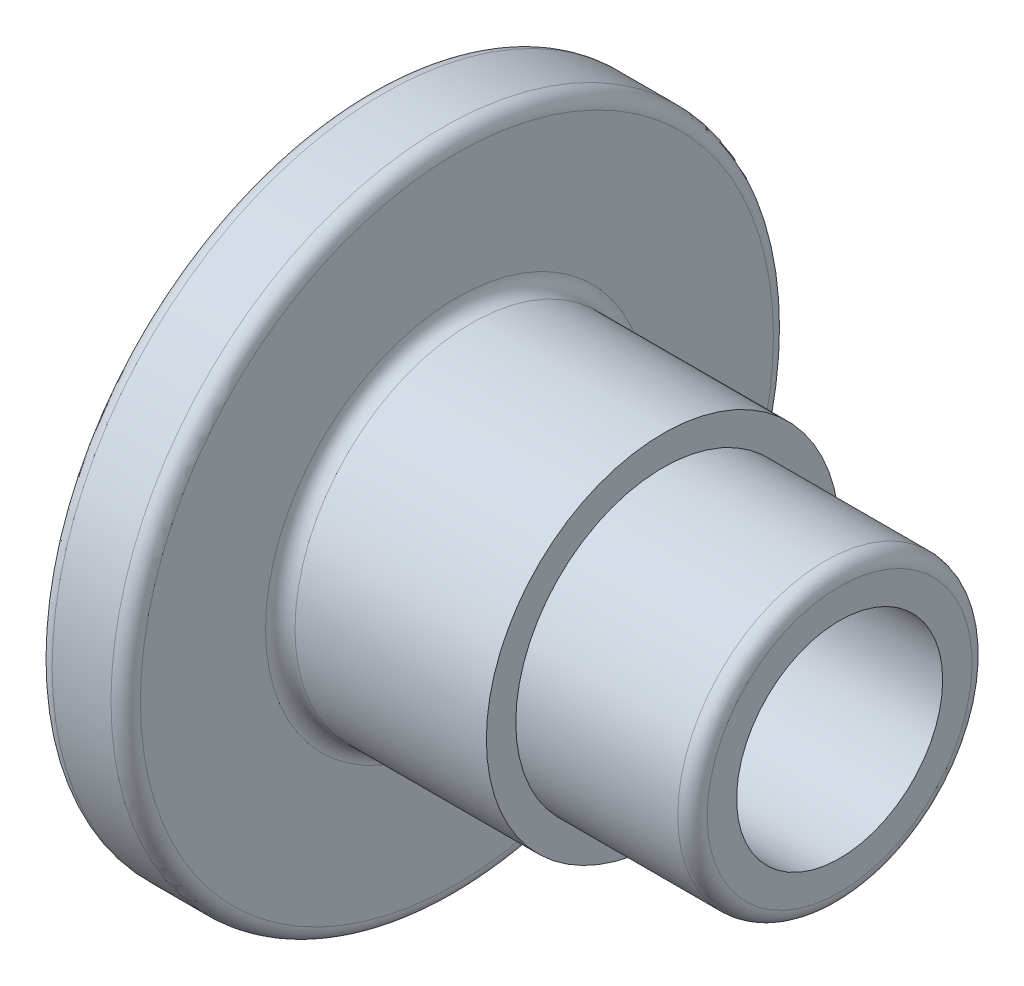
ISO-10303-21;
HEADER;
FILE_DESCRIPTION(('STEP AP214'),'2;1');
FILE_NAME('part.step','',(''),(''),'','','');
FILE_SCHEMA(('AUTOMOTIVE_DESIGN { 1 0 10303 214 1 1 1 1 }'));
ENDSEC;
DATA;
#1=APPLICATION_CONTEXT('core data for automotive mechanical design processes');
#2=APPLICATION_PROTOCOL_DEFINITION('international standard','automotive_design',2000,#1);
#3=PRODUCT_CONTEXT('',#1,'mechanical');
#4=PRODUCT('Part','Part','',(#3));
#5=PRODUCT_RELATED_PRODUCT_CATEGORY('part','',(#4));
#6=PRODUCT_DEFINITION_FORMATION('','',#4);
#7=PRODUCT_DEFINITION_CONTEXT('part definition',#1,'design');
#8=PRODUCT_DEFINITION('design','',#6,#7);
#9=PRODUCT_DEFINITION_SHAPE('','',#8);
#10=(LENGTH_UNIT() NAMED_UNIT(*) SI_UNIT(.MILLI.,.METRE.));
#11=(NAMED_UNIT(*) PLANE_ANGLE_UNIT() SI_UNIT($,.RADIAN.));
#12=(NAMED_UNIT(*) SI_UNIT($,.STERADIAN.) SOLID_ANGLE_UNIT());
#13=UNCERTAINTY_MEASURE_WITH_UNIT(LENGTH_MEASURE(1.E-05),#10,'distance_accuracy_value','');
#14=(GEOMETRIC_REPRESENTATION_CONTEXT(3) GLOBAL_UNCERTAINTY_ASSIGNED_CONTEXT((#13)) GLOBAL_UNIT_ASSIGNED_CONTEXT((#10,
#11,#12)) REPRESENTATION_CONTEXT('',''));
#15=CARTESIAN_POINT('',(0.,0.,0.));
#16=DIRECTION('',(0.,0.,1.));
#17=DIRECTION('',(1.,0.,0.));
#18=AXIS2_PLACEMENT_3D('',#15,#16,#17);
#19=CARTESIAN_POINT('',(16.,0.,0.));
#20=DIRECTION('',(1.,0.,0.));
#21=DIRECTION('',(0.,0.,-1.));
#22=AXIS2_PLACEMENT_3D('',#19,#20,#21);
#23=CYLINDRICAL_SURFACE('',#22,3.49999999999999);
#24=CARTESIAN_POINT('',(16.,0.,0.));
#25=DIRECTION('',(1.,0.,0.));
#26=DIRECTION('',(0.,0.,-1.));
#27=AXIS2_PLACEMENT_3D('',#24,#25,#26);
#28=CIRCLE('',#27,3.49999999999999);
#29=CARTESIAN_POINT('',(16.,0.,-3.49999999999999));
#30=VERTEX_POINT('',#29);
#31=EDGE_CURVE('E67',#30,#30,#28,.T.);
#32=ORIENTED_EDGE('',*,*,#31,.T.);
#33=EDGE_LOOP('',(#32));
#34=FACE_BOUND('',#33,.T.);
#35=CARTESIAN_POINT('',(5.,0.,0.));
#36=DIRECTION('',(-1.,0.,0.));
#37=DIRECTION('',(0.,0.,1.));
#38=AXIS2_PLACEMENT_3D('',#35,#36,#37);
#39=CIRCLE('',#38,3.49999999999999);
#40=CARTESIAN_POINT('',(5.,0.,3.49999999999999));
#41=VERTEX_POINT('',#40);
#42=EDGE_CURVE('E33',#41,#41,#39,.F.);
#43=ORIENTED_EDGE('',*,*,#42,.F.);
#44=EDGE_LOOP('',(#43));
#45=FACE_BOUND('',#44,.T.);
#46=ADVANCED_FACE('F29',(#34,#45),#23,.F.);
#47=CARTESIAN_POINT('',(0.,0.,0.));
#48=DIRECTION('',(1.,0.,0.));
#49=DIRECTION('',(0.,0.,-1.));
#50=AXIS2_PLACEMENT_3D('',#47,#48,#49);
#51=PLANE('',#50);
#52=CARTESIAN_POINT('',(0.,0.,0.));
#53=DIRECTION('',(-1.,0.,0.));
#54=DIRECTION('',(0.,0.,1.));
#55=AXIS2_PLACEMENT_3D('',#52,#53,#54);
#56=CIRCLE('',#55,5.);
#57=CARTESIAN_POINT('',(0.,0.,5.));
#58=VERTEX_POINT('',#57);
#59=EDGE_CURVE('E70',#58,#58,#56,.T.);
#60=ORIENTED_EDGE('',*,*,#59,.F.);
#61=EDGE_LOOP('',(#60));
#62=FACE_BOUND('',#61,.T.);
#63=CARTESIAN_POINT('',(0.,0.,0.));
#64=DIRECTION('',(1.,0.,0.));
#65=DIRECTION('',(0.,0.,-1.));
#66=AXIS2_PLACEMENT_3D('',#63,#64,#65);
#67=CIRCLE('',#66,10.75);
#68=CARTESIAN_POINT('',(0.,0.,-10.75));
#69=VERTEX_POINT('',#68);
#70=EDGE_CURVE('E52',#69,#69,#67,.F.);
#71=ORIENTED_EDGE('',*,*,#70,.T.);
#72=EDGE_LOOP('',(#71));
#73=FACE_BOUND('',#72,.T.);
#74=ADVANCED_FACE('F83',(#62,#73),#51,.F.);
#75=CARTESIAN_POINT('',(0.,0.,0.));
#76=DIRECTION('',(-1.,0.,0.));
#77=DIRECTION('',(0.,0.,1.));
#78=AXIS2_PLACEMENT_3D('',#75,#76,#77);
#79=CYLINDRICAL_SURFACE('',#78,11.25);
#80=CARTESIAN_POINT('',(0.5,0.,0.));
#81=DIRECTION('',(1.,0.,0.));
#82=DIRECTION('',(0.,0.,-1.));
#83=AXIS2_PLACEMENT_3D('',#80,#81,#82);
#84=CIRCLE('',#83,11.25);
#85=CARTESIAN_POINT('',(0.5,0.,-11.25));
#86=VERTEX_POINT('',#85);
#87=EDGE_CURVE('E46',#86,#86,#84,.T.);
#88=ORIENTED_EDGE('',*,*,#87,.T.);
#89=EDGE_LOOP('',(#88));
#90=FACE_BOUND('',#89,.T.);
#91=CARTESIAN_POINT('',(2.5,0.,0.));
#92=DIRECTION('',(-1.,0.,0.));
#93=DIRECTION('',(0.,0.,1.));
#94=AXIS2_PLACEMENT_3D('',#91,#92,#93);
#95=CIRCLE('',#94,11.25);
#96=CARTESIAN_POINT('',(2.5,0.,11.25));
#97=VERTEX_POINT('',#96);
#98=EDGE_CURVE('E49',#97,#97,#95,.T.);
#99=ORIENTED_EDGE('',*,*,#98,.T.);
#100=EDGE_LOOP('',(#99));
#101=FACE_BOUND('',#100,.T.);
#102=ADVANCED_FACE('F89',(#90,#101),#79,.T.);
#103=CARTESIAN_POINT('',(3.,11.25,0.));
#104=DIRECTION('',(-1.,0.,0.));
#105=DIRECTION('',(0.,0.,1.));
#106=AXIS2_PLACEMENT_3D('',#103,#104,#105);
#107=PLANE('',#106);
#108=CARTESIAN_POINT('',(3.,0.,0.));
#109=DIRECTION('',(-1.,0.,0.));
#110=DIRECTION('',(0.,0.,1.));
#111=AXIS2_PLACEMENT_3D('',#108,#109,#110);
#112=CIRCLE('',#111,10.75);
#113=CARTESIAN_POINT('',(3.,0.,10.75));
#114=VERTEX_POINT('',#113);
#115=EDGE_CURVE('E37',#114,#114,#112,.F.);
#116=ORIENTED_EDGE('',*,*,#115,.T.);
#117=EDGE_LOOP('',(#116));
#118=FACE_BOUND('',#117,.T.);
#119=CARTESIAN_POINT('',(3.,0.,0.));
#120=DIRECTION('',(-1.,0.,0.));
#121=DIRECTION('',(0.,0.,1.));
#122=AXIS2_PLACEMENT_3D('',#119,#120,#121);
#123=CIRCLE('',#122,6.5);
#124=CARTESIAN_POINT('',(3.,0.,6.5));
#125=VERTEX_POINT('',#124);
#126=EDGE_CURVE('E41',#125,#125,#123,.T.);
#127=ORIENTED_EDGE('',*,*,#126,.T.);
#128=EDGE_LOOP('',(#127));
#129=FACE_BOUND('',#128,.T.);
#130=ADVANCED_FACE('F112',(#118,#129),#107,.F.);
#131=CARTESIAN_POINT('',(0.,0.,0.));
#132=DIRECTION('',(-1.,0.,0.));
#133=DIRECTION('',(0.,0.,1.));
#134=AXIS2_PLACEMENT_3D('',#131,#132,#133);
#135=CYLINDRICAL_SURFACE('',#134,6.);
#136=CARTESIAN_POINT('',(3.5,0.,0.));
#137=DIRECTION('',(-1.,0.,0.));
#138=DIRECTION('',(0.,0.,1.));
#139=AXIS2_PLACEMENT_3D('',#136,#137,#138);
#140=CIRCLE('',#139,6.);
#141=CARTESIAN_POINT('',(3.5,0.,6.));
#142=VERTEX_POINT('',#141);
#143=EDGE_CURVE('E10',#142,#142,#140,.F.);
#144=ORIENTED_EDGE('',*,*,#143,.T.);
#145=EDGE_LOOP('',(#144));
#146=FACE_BOUND('',#145,.T.);
#147=CARTESIAN_POINT('',(10.,0.,0.));
#148=DIRECTION('',(-1.,0.,0.));
#149=DIRECTION('',(0.,0.,1.));
#150=AXIS2_PLACEMENT_3D('',#147,#148,#149);
#151=CIRCLE('',#150,6.);
#152=CARTESIAN_POINT('',(10.,0.,6.));
#153=VERTEX_POINT('',#152);
#154=EDGE_CURVE('E61',#153,#153,#151,.T.);
#155=ORIENTED_EDGE('',*,*,#154,.T.);
#156=EDGE_LOOP('',(#155));
#157=FACE_BOUND('',#156,.T.);
#158=ADVANCED_FACE('F108',(#146,#157),#135,.T.);
#159=CARTESIAN_POINT('',(10.,6.,0.));
#160=DIRECTION('',(-1.,0.,0.));
#161=DIRECTION('',(0.,0.,1.));
#162=AXIS2_PLACEMENT_3D('',#159,#160,#161);
#163=PLANE('',#162);
#164=ORIENTED_EDGE('',*,*,#154,.F.);
#165=EDGE_LOOP('',(#164));
#166=FACE_BOUND('',#165,.T.);
#167=CARTESIAN_POINT('',(10.,0.,0.));
#168=DIRECTION('',(-1.,0.,0.));
#169=DIRECTION('',(0.,0.,1.));
#170=AXIS2_PLACEMENT_3D('',#167,#168,#169);
#171=CIRCLE('',#170,5.);
#172=CARTESIAN_POINT('',(10.,0.,5.));
#173=VERTEX_POINT('',#172);
#174=EDGE_CURVE('E64',#173,#173,#171,.T.);
#175=ORIENTED_EDGE('',*,*,#174,.T.);
#176=EDGE_LOOP('',(#175));
#177=FACE_BOUND('',#176,.T.);
#178=ADVANCED_FACE('F104',(#166,#177),#163,.F.);
#179=CARTESIAN_POINT('',(0.,0.,0.));
#180=DIRECTION('',(-1.,0.,0.));
#181=DIRECTION('',(0.,0.,1.));
#182=AXIS2_PLACEMENT_3D('',#179,#180,#181);
#183=CYLINDRICAL_SURFACE('',#182,5.);
#184=CARTESIAN_POINT('',(15.5,0.,0.));
#185=DIRECTION('',(-1.,0.,0.));
#186=DIRECTION('',(0.,0.,1.));
#187=AXIS2_PLACEMENT_3D('',#184,#185,#186);
#188=CIRCLE('',#187,5.);
#189=CARTESIAN_POINT('',(15.5,0.,5.));
#190=VERTEX_POINT('',#189);
#191=EDGE_CURVE('E58',#190,#190,#188,.T.);
#192=ORIENTED_EDGE('',*,*,#191,.T.);
#193=EDGE_LOOP('',(#192));
#194=FACE_BOUND('',#193,.T.);
#195=ORIENTED_EDGE('',*,*,#174,.F.);
#196=EDGE_LOOP('',(#195));
#197=FACE_BOUND('',#196,.T.);
#198=ADVANCED_FACE('F100',(#194,#197),#183,.T.);
#199=CARTESIAN_POINT('',(16.,5.,0.));
#200=DIRECTION('',(-1.,0.,0.));
#201=DIRECTION('',(0.,0.,1.));
#202=AXIS2_PLACEMENT_3D('',#199,#200,#201);
#203=PLANE('',#202);
#204=ORIENTED_EDGE('',*,*,#31,.F.);
#205=EDGE_LOOP('',(#204));
#206=FACE_BOUND('',#205,.T.);
#207=CARTESIAN_POINT('',(16.,0.,0.));
#208=DIRECTION('',(-1.,0.,0.));
#209=DIRECTION('',(0.,0.,1.));
#210=AXIS2_PLACEMENT_3D('',#207,#208,#209);
#211=CIRCLE('',#210,4.5);
#212=CARTESIAN_POINT('',(16.,0.,4.5));
#213=VERTEX_POINT('',#212);
#214=EDGE_CURVE('E55',#213,#213,#211,.F.);
#215=ORIENTED_EDGE('',*,*,#214,.T.);
#216=EDGE_LOOP('',(#215));
#217=FACE_BOUND('',#216,.T.);
#218=ADVANCED_FACE('F96',(#206,#217),#203,.F.);
#219=CARTESIAN_POINT('',(15.5,0.,0.));
#220=DIRECTION('',(-1.,0.,0.));
#221=DIRECTION('',(0.,0.,1.));
#222=AXIS2_PLACEMENT_3D('',#219,#220,#221);
#223=TOROIDAL_SURFACE('',#222,4.5,0.5);
#224=ORIENTED_EDGE('',*,*,#214,.F.);
#225=EDGE_LOOP('',(#224));
#226=FACE_BOUND('',#225,.T.);
#227=ORIENTED_EDGE('',*,*,#191,.F.);
#228=EDGE_LOOP('',(#227));
#229=FACE_BOUND('',#228,.T.);
#230=ADVANCED_FACE('F99',(#226,#229),#223,.T.);
#231=CARTESIAN_POINT('',(0.5,0.,0.));
#232=DIRECTION('',(1.,0.,0.));
#233=DIRECTION('',(0.,0.,-1.));
#234=AXIS2_PLACEMENT_3D('',#231,#232,#233);
#235=TOROIDAL_SURFACE('',#234,10.75,0.5);
#236=ORIENTED_EDGE('',*,*,#87,.F.);
#237=EDGE_LOOP('',(#236));
#238=FACE_BOUND('',#237,.T.);
#239=ORIENTED_EDGE('',*,*,#70,.F.);
#240=EDGE_LOOP('',(#239));
#241=FACE_BOUND('',#240,.T.);
#242=ADVANCED_FACE('F121',(#238,#241),#235,.T.);
#243=CARTESIAN_POINT('',(2.5,0.,0.));
#244=DIRECTION('',(-1.,0.,0.));
#245=DIRECTION('',(0.,0.,1.));
#246=AXIS2_PLACEMENT_3D('',#243,#244,#245);
#247=TOROIDAL_SURFACE('',#246,10.75,0.5);
#248=ORIENTED_EDGE('',*,*,#115,.F.);
#249=EDGE_LOOP('',(#248));
#250=FACE_BOUND('',#249,.T.);
#251=ORIENTED_EDGE('',*,*,#98,.F.);
#252=EDGE_LOOP('',(#251));
#253=FACE_BOUND('',#252,.T.);
#254=ADVANCED_FACE('F124',(#250,#253),#247,.T.);
#255=CARTESIAN_POINT('',(3.5,0.,0.));
#256=DIRECTION('',(-1.,0.,0.));
#257=DIRECTION('',(0.,0.,1.));
#258=AXIS2_PLACEMENT_3D('',#255,#256,#257);
#259=TOROIDAL_SURFACE('',#258,6.5,0.5);
#260=ORIENTED_EDGE('',*,*,#143,.F.);
#261=EDGE_LOOP('',(#260));
#262=FACE_BOUND('',#261,.T.);
#263=ORIENTED_EDGE('',*,*,#126,.F.);
#264=EDGE_LOOP('',(#263));
#265=FACE_BOUND('',#264,.T.);
#266=ADVANCED_FACE('F31',(#262,#265),#259,.F.);
#267=CARTESIAN_POINT('',(5.,0.,0.));
#268=DIRECTION('',(-1.,0.,0.));
#269=DIRECTION('',(0.,0.,1.));
#270=AXIS2_PLACEMENT_3D('',#267,#268,#269);
#271=PLANE('',#270);
#272=CARTESIAN_POINT('',(5.,0.,0.));
#273=DIRECTION('',(-1.,0.,0.));
#274=DIRECTION('',(0.,0.,1.));
#275=AXIS2_PLACEMENT_3D('',#272,#273,#274);
#276=CIRCLE('',#275,5.);
#277=CARTESIAN_POINT('',(5.,0.,5.));
#278=VERTEX_POINT('',#277);
#279=EDGE_CURVE('E73',#278,#278,#276,.T.);
#280=ORIENTED_EDGE('',*,*,#279,.T.);
#281=EDGE_LOOP('',(#280));
#282=FACE_BOUND('',#281,.T.);
#283=ORIENTED_EDGE('',*,*,#42,.T.);
#284=EDGE_LOOP('',(#283));
#285=FACE_BOUND('',#284,.T.);
#286=ADVANCED_FACE('F80',(#282,#285),#271,.T.);
#287=CARTESIAN_POINT('',(5.,0.,0.));
#288=DIRECTION('',(-1.,0.,0.));
#289=DIRECTION('',(0.,0.,1.));
#290=AXIS2_PLACEMENT_3D('',#287,#288,#289);
#291=CYLINDRICAL_SURFACE('',#290,5.);
#292=ORIENTED_EDGE('',*,*,#279,.F.);
#293=EDGE_LOOP('',(#292));
#294=FACE_BOUND('',#293,.T.);
#295=ORIENTED_EDGE('',*,*,#59,.T.);
#296=EDGE_LOOP('',(#295));
#297=FACE_BOUND('',#296,.T.);
#298=ADVANCED_FACE('F94',(#294,#297),#291,.F.);
#299=CLOSED_SHELL('',(#46,#74,#102,#130,#158,#178,#198,#218,#230,#242,#254,#266,#286,#298));
#300=MANIFOLD_SOLID_BREP('B2',#299);
#301=ADVANCED_BREP_SHAPE_REPRESENTATION('',(#18,#300),#14);
#302=SHAPE_DEFINITION_REPRESENTATION(#9,#301);
ENDSEC;
END-ISO-10303-21;
